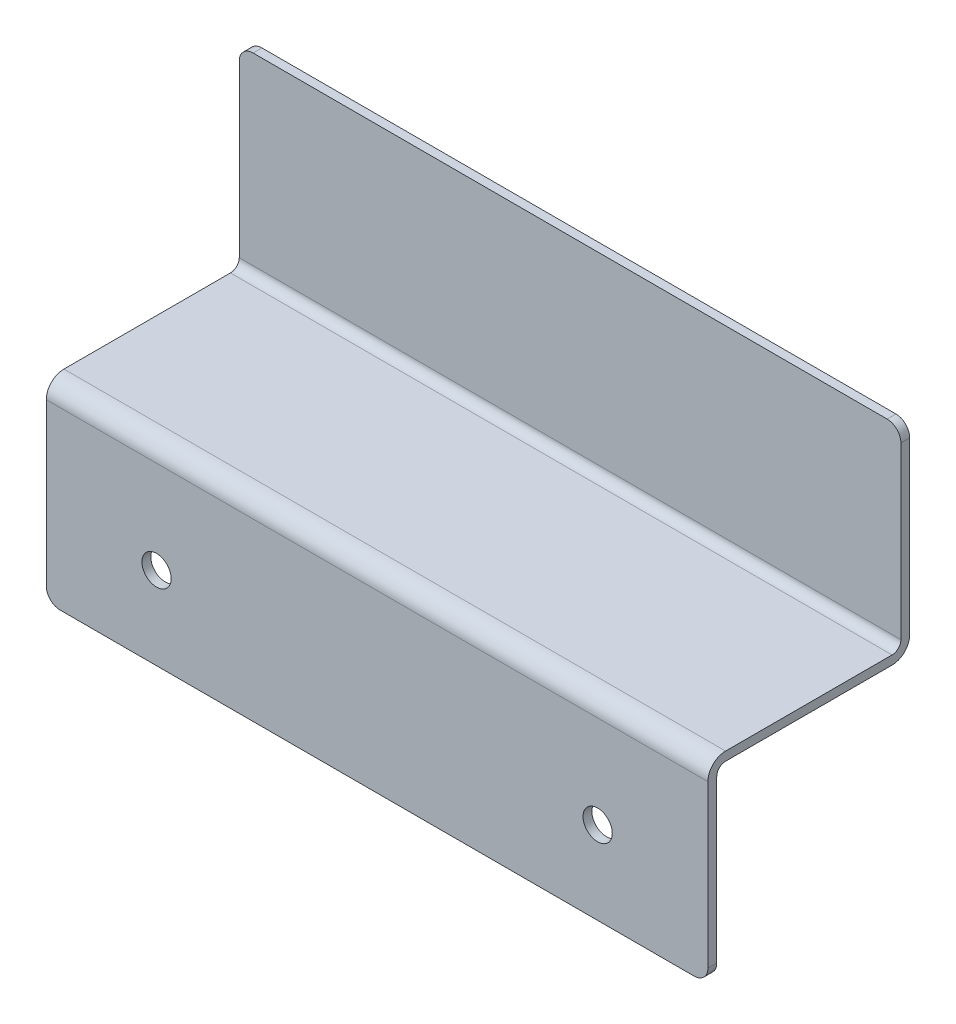
ISO-10303-21;
HEADER;
FILE_DESCRIPTION(('STEP AP214'),'2;1');
FILE_NAME('part.step','',(''),(''),'','','');
FILE_SCHEMA(('AUTOMOTIVE_DESIGN { 1 0 10303 214 1 1 1 1 }'));
ENDSEC;
DATA;
#1=APPLICATION_CONTEXT('core data for automotive mechanical design processes');
#2=APPLICATION_PROTOCOL_DEFINITION('international standard','automotive_design',2000,#1);
#3=PRODUCT_CONTEXT('',#1,'mechanical');
#4=PRODUCT('Part','Part','',(#3));
#5=PRODUCT_RELATED_PRODUCT_CATEGORY('part','',(#4));
#6=PRODUCT_DEFINITION_FORMATION('','',#4);
#7=PRODUCT_DEFINITION_CONTEXT('part definition',#1,'design');
#8=PRODUCT_DEFINITION('design','',#6,#7);
#9=PRODUCT_DEFINITION_SHAPE('','',#8);
#10=(LENGTH_UNIT() NAMED_UNIT(*) SI_UNIT(.MILLI.,.METRE.));
#11=(NAMED_UNIT(*) PLANE_ANGLE_UNIT() SI_UNIT($,.RADIAN.));
#12=(NAMED_UNIT(*) SI_UNIT($,.STERADIAN.) SOLID_ANGLE_UNIT());
#13=UNCERTAINTY_MEASURE_WITH_UNIT(LENGTH_MEASURE(1.E-05),#10,'distance_accuracy_value','');
#14=(GEOMETRIC_REPRESENTATION_CONTEXT(3) GLOBAL_UNCERTAINTY_ASSIGNED_CONTEXT((#13)) GLOBAL_UNIT_ASSIGNED_CONTEXT((#10,
#11,#12)) REPRESENTATION_CONTEXT('',''));
#15=CARTESIAN_POINT('',(0.,0.,0.));
#16=DIRECTION('',(0.,0.,1.));
#17=DIRECTION('',(1.,0.,0.));
#18=AXIS2_PLACEMENT_3D('',#15,#16,#17);
#19=CARTESIAN_POINT('',(152.4,0.,0.));
#20=DIRECTION('',(0.,-1.,0.));
#21=DIRECTION('',(0.,0.,-1.));
#22=AXIS2_PLACEMENT_3D('',#19,#20,#21);
#23=PLANE('',#22);
#24=DIRECTION('',(-1.,0.,0.));
#25=VECTOR('',#24,1.);
#26=CARTESIAN_POINT('',(152.4,0.,-2.032));
#27=LINE('',#26,#25);
#28=CARTESIAN_POINT('',(149.225,0.,-2.032));
#29=VERTEX_POINT('',#28);
#30=CARTESIAN_POINT('',(3.17500000000007,0.,-2.032));
#31=VERTEX_POINT('',#30);
#32=EDGE_CURVE('E187',#29,#31,#27,.T.);
#33=ORIENTED_EDGE('',*,*,#32,.T.);
#34=DIRECTION('',(0.,0.,1.));
#35=VECTOR('',#34,1.);
#36=CARTESIAN_POINT('',(3.17500000000001,0.,0.));
#37=LINE('',#36,#35);
#38=CARTESIAN_POINT('',(3.17500000000007,0.,0.));
#39=VERTEX_POINT('',#38);
#40=EDGE_CURVE('E247',#31,#39,#37,.T.);
#41=ORIENTED_EDGE('',*,*,#40,.T.);
#42=DIRECTION('',(-1.,0.,0.));
#43=VECTOR('',#42,1.);
#44=CARTESIAN_POINT('',(152.4,0.,0.));
#45=LINE('',#44,#43);
#46=CARTESIAN_POINT('',(149.225,0.,0.));
#47=VERTEX_POINT('',#46);
#48=EDGE_CURVE('E172',#47,#39,#45,.T.);
#49=ORIENTED_EDGE('',*,*,#48,.F.);
#50=DIRECTION('',(0.,0.,1.));
#51=VECTOR('',#50,1.);
#52=CARTESIAN_POINT('',(149.225,0.,0.));
#53=LINE('',#52,#51);
#54=EDGE_CURVE('E245',#47,#29,#53,.F.);
#55=ORIENTED_EDGE('',*,*,#54,.T.);
#56=EDGE_LOOP('',(#33,#41,#49,#55));
#57=FACE_BOUND('',#56,.T.);
#58=ADVANCED_FACE('F32',(#57),#23,.F.);
#59=CARTESIAN_POINT('',(152.4,0.,0.));
#60=DIRECTION('',(0.,0.,-1.));
#61=DIRECTION('',(0.,1.,0.));
#62=AXIS2_PLACEMENT_3D('',#59,#60,#61);
#63=PLANE('',#62);
#64=ORIENTED_EDGE('',*,*,#48,.T.);
#65=CARTESIAN_POINT('',(3.17500000000001,-3.175,0.));
#66=DIRECTION('',(0.,0.,-1.));
#67=DIRECTION('',(0.,1.,0.));
#68=AXIS2_PLACEMENT_3D('',#65,#66,#67);
#69=CIRCLE('',#68,3.175);
#70=CARTESIAN_POINT('',(0.,-3.175,0.));
#71=VERTEX_POINT('',#70);
#72=EDGE_CURVE('E251',#39,#71,#69,.F.);
#73=ORIENTED_EDGE('',*,*,#72,.T.);
#74=DIRECTION('',(0.,-1.,0.));
#75=VECTOR('',#74,1.);
#76=CARTESIAN_POINT('',(0.,0.,0.));
#77=LINE('',#76,#75);
#78=CARTESIAN_POINT('',(0.,-42.418,0.));
#79=VERTEX_POINT('',#78);
#80=EDGE_CURVE('E262',#71,#79,#77,.T.);
#81=ORIENTED_EDGE('',*,*,#80,.T.);
#82=DIRECTION('',(-1.,0.,0.));
#83=VECTOR('',#82,1.);
#84=CARTESIAN_POINT('',(152.4,-42.418,0.));
#85=LINE('',#84,#83);
#86=CARTESIAN_POINT('',(152.4,-42.418,0.));
#87=VERTEX_POINT('',#86);
#88=EDGE_CURVE('E162',#79,#87,#85,.F.);
#89=ORIENTED_EDGE('',*,*,#88,.T.);
#90=DIRECTION('',(0.,-1.,0.));
#91=VECTOR('',#90,1.);
#92=CARTESIAN_POINT('',(152.4,0.,0.));
#93=LINE('',#92,#91);
#94=CARTESIAN_POINT('',(152.4,-3.175,0.));
#95=VERTEX_POINT('',#94);
#96=EDGE_CURVE('E181',#95,#87,#93,.T.);
#97=ORIENTED_EDGE('',*,*,#96,.F.);
#98=CARTESIAN_POINT('',(149.225,-3.175,0.));
#99=DIRECTION('',(0.,0.,-1.));
#100=DIRECTION('',(0.,1.,0.));
#101=AXIS2_PLACEMENT_3D('',#98,#99,#100);
#102=CIRCLE('',#101,3.175);
#103=EDGE_CURVE('E57',#95,#47,#102,.F.);
#104=ORIENTED_EDGE('',*,*,#103,.T.);
#105=EDGE_LOOP('',(#64,#73,#81,#89,#97,#104));
#106=FACE_BOUND('',#105,.T.);
#107=ADVANCED_FACE('F334',(#106),#63,.F.);
#108=CARTESIAN_POINT('',(152.4,-44.45,0.));
#109=DIRECTION('',(0.,-1.,0.));
#110=DIRECTION('',(0.,0.,-1.));
#111=AXIS2_PLACEMENT_3D('',#108,#109,#110);
#112=PLANE('',#111);
#113=DIRECTION('',(0.,0.,1.));
#114=VECTOR('',#113,1.);
#115=CARTESIAN_POINT('',(0.,-44.45,0.));
#116=LINE('',#115,#114);
#117=CARTESIAN_POINT('',(0.,-44.45,2.03199999999999));
#118=VERTEX_POINT('',#117);
#119=CARTESIAN_POINT('',(0.,-44.45,40.386));
#120=VERTEX_POINT('',#119);
#121=EDGE_CURVE('E283',#118,#120,#116,.T.);
#122=ORIENTED_EDGE('',*,*,#121,.T.);
#123=DIRECTION('',(-1.,0.,0.));
#124=VECTOR('',#123,1.);
#125=CARTESIAN_POINT('',(152.4,-44.45,40.386));
#126=LINE('',#125,#124);
#127=CARTESIAN_POINT('',(152.4,-44.45,40.386));
#128=VERTEX_POINT('',#127);
#129=EDGE_CURVE('E217',#120,#128,#126,.F.);
#130=ORIENTED_EDGE('',*,*,#129,.T.);
#131=DIRECTION('',(0.,0.,1.));
#132=VECTOR('',#131,1.);
#133=CARTESIAN_POINT('',(152.4,-44.45,0.));
#134=LINE('',#133,#132);
#135=CARTESIAN_POINT('',(152.4,-44.45,2.03199999999999));
#136=VERTEX_POINT('',#135);
#137=EDGE_CURVE('E272',#136,#128,#134,.T.);
#138=ORIENTED_EDGE('',*,*,#137,.F.);
#139=DIRECTION('',(-1.,0.,0.));
#140=VECTOR('',#139,1.);
#141=CARTESIAN_POINT('',(0.,-44.45,2.03199999999999));
#142=LINE('',#141,#140);
#143=EDGE_CURVE('E200',#136,#118,#142,.T.);
#144=ORIENTED_EDGE('',*,*,#143,.T.);
#145=EDGE_LOOP('',(#122,#130,#138,#144));
#146=FACE_BOUND('',#145,.T.);
#147=ADVANCED_FACE('F316',(#146),#112,.F.);
#148=CARTESIAN_POINT('',(152.4,-44.45,44.45));
#149=DIRECTION('',(0.,0.,-1.));
#150=DIRECTION('',(0.,1.,0.));
#151=AXIS2_PLACEMENT_3D('',#148,#149,#150);
#152=PLANE('',#151);
#153=CARTESIAN_POINT('',(25.4,-69.85,44.45));
#154=DIRECTION('',(0.,0.,1.));
#155=DIRECTION('',(1.,0.,0.));
#156=AXIS2_PLACEMENT_3D('',#153,#154,#155);
#157=CIRCLE('',#156,3.3655);
#158=CARTESIAN_POINT('',(28.7655,-69.85,44.45));
#159=VERTEX_POINT('',#158);
#160=EDGE_CURVE('E258',#159,#159,#157,.T.);
#161=ORIENTED_EDGE('',*,*,#160,.F.);
#162=EDGE_LOOP('',(#161));
#163=FACE_BOUND('',#162,.T.);
#164=CARTESIAN_POINT('',(127.,-69.85,44.45));
#165=DIRECTION('',(0.,0.,1.));
#166=DIRECTION('',(1.,0.,0.));
#167=AXIS2_PLACEMENT_3D('',#164,#165,#166);
#168=CIRCLE('',#167,3.36549999999999);
#169=CARTESIAN_POINT('',(130.3655,-69.85,44.45));
#170=VERTEX_POINT('',#169);
#171=EDGE_CURVE('E264',#170,#170,#168,.T.);
#172=ORIENTED_EDGE('',*,*,#171,.F.);
#173=EDGE_LOOP('',(#172));
#174=FACE_BOUND('',#173,.T.);
#175=DIRECTION('',(0.,-1.,0.));
#176=VECTOR('',#175,1.);
#177=CARTESIAN_POINT('',(0.,-44.45,44.45));
#178=LINE('',#177,#176);
#179=CARTESIAN_POINT('',(0.,-48.514,44.45));
#180=VERTEX_POINT('',#179);
#181=CARTESIAN_POINT('',(0.,-85.725,44.45));
#182=VERTEX_POINT('',#181);
#183=EDGE_CURVE('E183',#180,#182,#178,.T.);
#184=ORIENTED_EDGE('',*,*,#183,.T.);
#185=CARTESIAN_POINT('',(3.17500000000001,-85.725,44.45));
#186=DIRECTION('',(0.,0.,-1.));
#187=DIRECTION('',(0.,1.,0.));
#188=AXIS2_PLACEMENT_3D('',#185,#186,#187);
#189=CIRCLE('',#188,3.175);
#190=CARTESIAN_POINT('',(3.17500000000007,-88.9,44.45));
#191=VERTEX_POINT('',#190);
#192=EDGE_CURVE('E243',#182,#191,#189,.F.);
#193=ORIENTED_EDGE('',*,*,#192,.T.);
#194=DIRECTION('',(-1.,0.,0.));
#195=VECTOR('',#194,1.);
#196=CARTESIAN_POINT('',(152.4,-88.9,44.45));
#197=LINE('',#196,#195);
#198=CARTESIAN_POINT('',(149.225,-88.9,44.45));
#199=VERTEX_POINT('',#198);
#200=EDGE_CURVE('E194',#199,#191,#197,.T.);
#201=ORIENTED_EDGE('',*,*,#200,.F.);
#202=CARTESIAN_POINT('',(149.225,-85.725,44.45));
#203=DIRECTION('',(0.,0.,-1.));
#204=DIRECTION('',(0.,1.,0.));
#205=AXIS2_PLACEMENT_3D('',#202,#203,#204);
#206=CIRCLE('',#205,3.175);
#207=CARTESIAN_POINT('',(152.4,-85.725,44.45));
#208=VERTEX_POINT('',#207);
#209=EDGE_CURVE('E241',#199,#208,#206,.F.);
#210=ORIENTED_EDGE('',*,*,#209,.T.);
#211=DIRECTION('',(0.,-1.,0.));
#212=VECTOR('',#211,1.);
#213=CARTESIAN_POINT('',(152.4,-44.45,44.45));
#214=LINE('',#213,#212);
#215=CARTESIAN_POINT('',(152.4,-48.514,44.45));
#216=VERTEX_POINT('',#215);
#217=EDGE_CURVE('E275',#216,#208,#214,.T.);
#218=ORIENTED_EDGE('',*,*,#217,.F.);
#219=DIRECTION('',(-1.,0.,0.));
#220=VECTOR('',#219,1.);
#221=CARTESIAN_POINT('',(152.4,-48.514,44.45));
#222=LINE('',#221,#220);
#223=EDGE_CURVE('E211',#216,#180,#222,.T.);
#224=ORIENTED_EDGE('',*,*,#223,.T.);
#225=EDGE_LOOP('',(#184,#193,#201,#210,#218,#224));
#226=FACE_BOUND('',#225,.T.);
#227=ADVANCED_FACE('F289',(#163,#174,#226),#152,.F.);
#228=CARTESIAN_POINT('',(152.4,-88.9,44.45));
#229=DIRECTION('',(0.,1.,0.));
#230=DIRECTION('',(0.,0.,1.));
#231=AXIS2_PLACEMENT_3D('',#228,#229,#230);
#232=PLANE('',#231);
#233=ORIENTED_EDGE('',*,*,#200,.T.);
#234=DIRECTION('',(0.,0.,-1.));
#235=VECTOR('',#234,1.);
#236=CARTESIAN_POINT('',(3.17500000000001,-88.9,42.418));
#237=LINE('',#236,#235);
#238=CARTESIAN_POINT('',(3.17500000000007,-88.9,42.418));
#239=VERTEX_POINT('',#238);
#240=EDGE_CURVE('E230',#191,#239,#237,.T.);
#241=ORIENTED_EDGE('',*,*,#240,.T.);
#242=DIRECTION('',(-1.,0.,0.));
#243=VECTOR('',#242,1.);
#244=CARTESIAN_POINT('',(152.4,-88.9,42.418));
#245=LINE('',#244,#243);
#246=CARTESIAN_POINT('',(149.225,-88.9,42.418));
#247=VERTEX_POINT('',#246);
#248=EDGE_CURVE('E190',#247,#239,#245,.T.);
#249=ORIENTED_EDGE('',*,*,#248,.F.);
#250=DIRECTION('',(0.,0.,-1.));
#251=VECTOR('',#250,1.);
#252=CARTESIAN_POINT('',(149.225,-88.9,44.45));
#253=LINE('',#252,#251);
#254=EDGE_CURVE('E228',#247,#199,#253,.F.);
#255=ORIENTED_EDGE('',*,*,#254,.T.);
#256=EDGE_LOOP('',(#233,#241,#249,#255));
#257=FACE_BOUND('',#256,.T.);
#258=ADVANCED_FACE('F299',(#257),#232,.F.);
#259=CARTESIAN_POINT('',(152.4,-46.482,42.418));
#260=DIRECTION('',(0.,0.,1.));
#261=DIRECTION('',(0.,-1.,0.));
#262=AXIS2_PLACEMENT_3D('',#259,#260,#261);
#263=PLANE('',#262);
#264=CARTESIAN_POINT('',(25.4,-69.85,42.418));
#265=DIRECTION('',(0.,0.,1.));
#266=DIRECTION('',(0.,-1.,0.));
#267=AXIS2_PLACEMENT_3D('',#264,#265,#266);
#268=CIRCLE('',#267,3.3655);
#269=CARTESIAN_POINT('',(25.4,-73.2155,42.418));
#270=VERTEX_POINT('',#269);
#271=EDGE_CURVE('E36',#270,#270,#268,.T.);
#272=ORIENTED_EDGE('',*,*,#271,.T.);
#273=EDGE_LOOP('',(#272));
#274=FACE_BOUND('',#273,.T.);
#275=CARTESIAN_POINT('',(127.,-69.85,42.418));
#276=DIRECTION('',(0.,0.,1.));
#277=DIRECTION('',(0.,-1.,0.));
#278=AXIS2_PLACEMENT_3D('',#275,#276,#277);
#279=CIRCLE('',#278,3.36549999999999);
#280=CARTESIAN_POINT('',(127.,-73.2155,42.418));
#281=VERTEX_POINT('',#280);
#282=EDGE_CURVE('E256',#281,#281,#279,.T.);
#283=ORIENTED_EDGE('',*,*,#282,.T.);
#284=EDGE_LOOP('',(#283));
#285=FACE_BOUND('',#284,.T.);
#286=ORIENTED_EDGE('',*,*,#248,.T.);
#287=CARTESIAN_POINT('',(3.17500000000001,-85.725,42.418));
#288=DIRECTION('',(0.,0.,1.));
#289=DIRECTION('',(0.,-1.,0.));
#290=AXIS2_PLACEMENT_3D('',#287,#288,#289);
#291=CIRCLE('',#290,3.175);
#292=CARTESIAN_POINT('',(0.,-85.725,42.418));
#293=VERTEX_POINT('',#292);
#294=EDGE_CURVE('E235',#239,#293,#291,.F.);
#295=ORIENTED_EDGE('',*,*,#294,.T.);
#296=DIRECTION('',(0.,1.,0.));
#297=VECTOR('',#296,1.);
#298=CARTESIAN_POINT('',(0.,-46.482,42.418));
#299=LINE('',#298,#297);
#300=CARTESIAN_POINT('',(0.,-48.514,42.418));
#301=VERTEX_POINT('',#300);
#302=EDGE_CURVE('E178',#293,#301,#299,.T.);
#303=ORIENTED_EDGE('',*,*,#302,.T.);
#304=DIRECTION('',(-1.,0.,0.));
#305=VECTOR('',#304,1.);
#306=CARTESIAN_POINT('',(152.4,-48.514,42.418));
#307=LINE('',#306,#305);
#308=CARTESIAN_POINT('',(152.4,-48.514,42.418));
#309=VERTEX_POINT('',#308);
#310=EDGE_CURVE('E157',#301,#309,#307,.F.);
#311=ORIENTED_EDGE('',*,*,#310,.T.);
#312=DIRECTION('',(0.,1.,0.));
#313=VECTOR('',#312,1.);
#314=CARTESIAN_POINT('',(152.4,-46.482,42.418));
#315=LINE('',#314,#313);
#316=CARTESIAN_POINT('',(152.4,-85.725,42.418));
#317=VERTEX_POINT('',#316);
#318=EDGE_CURVE('E278',#317,#309,#315,.T.);
#319=ORIENTED_EDGE('',*,*,#318,.F.);
#320=CARTESIAN_POINT('',(149.225,-85.725,42.418));
#321=DIRECTION('',(0.,0.,1.));
#322=DIRECTION('',(0.,-1.,0.));
#323=AXIS2_PLACEMENT_3D('',#320,#321,#322);
#324=CIRCLE('',#323,3.175);
#325=EDGE_CURVE('E233',#317,#247,#324,.F.);
#326=ORIENTED_EDGE('',*,*,#325,.T.);
#327=EDGE_LOOP('',(#286,#295,#303,#311,#319,#326));
#328=FACE_BOUND('',#327,.T.);
#329=ADVANCED_FACE('F302',(#274,#285,#328),#263,.F.);
#330=CARTESIAN_POINT('',(152.4,-46.482,-2.03200000000001));
#331=DIRECTION('',(0.,1.,0.));
#332=DIRECTION('',(0.,0.,1.));
#333=AXIS2_PLACEMENT_3D('',#330,#331,#332);
#334=PLANE('',#333);
#335=DIRECTION('',(0.,0.,-1.));
#336=VECTOR('',#335,1.);
#337=CARTESIAN_POINT('',(0.,-46.482,-2.03200000000001));
#338=LINE('',#337,#336);
#339=CARTESIAN_POINT('',(0.,-46.482,40.386));
#340=VERTEX_POINT('',#339);
#341=CARTESIAN_POINT('',(0.,-46.482,2.03199999999999));
#342=VERTEX_POINT('',#341);
#343=EDGE_CURVE('E168',#340,#342,#338,.T.);
#344=ORIENTED_EDGE('',*,*,#343,.T.);
#345=DIRECTION('',(-1.,0.,0.));
#346=VECTOR('',#345,1.);
#347=CARTESIAN_POINT('',(152.4,-46.482,2.03199999999999));
#348=LINE('',#347,#346);
#349=CARTESIAN_POINT('',(152.4,-46.482,2.03199999999999));
#350=VERTEX_POINT('',#349);
#351=EDGE_CURVE('E226',#342,#350,#348,.F.);
#352=ORIENTED_EDGE('',*,*,#351,.T.);
#353=DIRECTION('',(0.,0.,-1.));
#354=VECTOR('',#353,1.);
#355=CARTESIAN_POINT('',(152.4,-46.482,-2.03200000000001));
#356=LINE('',#355,#354);
#357=CARTESIAN_POINT('',(152.4,-46.482,40.386));
#358=VERTEX_POINT('',#357);
#359=EDGE_CURVE('E171',#358,#350,#356,.T.);
#360=ORIENTED_EDGE('',*,*,#359,.F.);
#361=DIRECTION('',(-1.,0.,0.));
#362=VECTOR('',#361,1.);
#363=CARTESIAN_POINT('',(0.,-46.482,40.386));
#364=LINE('',#363,#362);
#365=EDGE_CURVE('E155',#358,#340,#364,.T.);
#366=ORIENTED_EDGE('',*,*,#365,.T.);
#367=EDGE_LOOP('',(#344,#352,#360,#366));
#368=FACE_BOUND('',#367,.T.);
#369=ADVANCED_FACE('F167',(#368),#334,.F.);
#370=CARTESIAN_POINT('',(152.4,0.,-2.032));
#371=DIRECTION('',(0.,0.,1.));
#372=DIRECTION('',(0.,-1.,0.));
#373=AXIS2_PLACEMENT_3D('',#370,#371,#372);
#374=PLANE('',#373);
#375=DIRECTION('',(0.,1.,0.));
#376=VECTOR('',#375,1.);
#377=CARTESIAN_POINT('',(0.,0.,-2.032));
#378=LINE('',#377,#376);
#379=CARTESIAN_POINT('',(0.,-42.418,-2.03200000000001));
#380=VERTEX_POINT('',#379);
#381=CARTESIAN_POINT('',(0.,-3.175,-2.032));
#382=VERTEX_POINT('',#381);
#383=EDGE_CURVE('E177',#380,#382,#378,.T.);
#384=ORIENTED_EDGE('',*,*,#383,.T.);
#385=CARTESIAN_POINT('',(3.17500000000001,-3.175,-2.032));
#386=DIRECTION('',(0.,0.,1.));
#387=DIRECTION('',(0.,-1.,0.));
#388=AXIS2_PLACEMENT_3D('',#385,#386,#387);
#389=CIRCLE('',#388,3.175);
#390=EDGE_CURVE('E254',#382,#31,#389,.F.);
#391=ORIENTED_EDGE('',*,*,#390,.T.);
#392=ORIENTED_EDGE('',*,*,#32,.F.);
#393=CARTESIAN_POINT('',(149.225,-3.175,-2.032));
#394=DIRECTION('',(0.,0.,1.));
#395=DIRECTION('',(0.,-1.,0.));
#396=AXIS2_PLACEMENT_3D('',#393,#394,#395);
#397=CIRCLE('',#396,3.175);
#398=CARTESIAN_POINT('',(152.4,-3.175,-2.032));
#399=VERTEX_POINT('',#398);
#400=EDGE_CURVE('E49',#29,#399,#397,.F.);
#401=ORIENTED_EDGE('',*,*,#400,.T.);
#402=DIRECTION('',(0.,1.,0.));
#403=VECTOR('',#402,1.);
#404=CARTESIAN_POINT('',(152.4,0.,-2.032));
#405=LINE('',#404,#403);
#406=CARTESIAN_POINT('',(152.4,-42.418,-2.03200000000001));
#407=VERTEX_POINT('',#406);
#408=EDGE_CURVE('E191',#407,#399,#405,.T.);
#409=ORIENTED_EDGE('',*,*,#408,.F.);
#410=DIRECTION('',(-1.,0.,0.));
#411=VECTOR('',#410,1.);
#412=CARTESIAN_POINT('',(152.4,-42.418,-2.03200000000001));
#413=LINE('',#412,#411);
#414=EDGE_CURVE('E223',#407,#380,#413,.T.);
#415=ORIENTED_EDGE('',*,*,#414,.T.);
#416=EDGE_LOOP('',(#384,#391,#392,#401,#409,#415));
#417=FACE_BOUND('',#416,.T.);
#418=ADVANCED_FACE('F330',(#417),#374,.F.);
#419=CARTESIAN_POINT('',(152.4,0.,0.));
#420=DIRECTION('',(-1.,0.,0.));
#421=DIRECTION('',(0.,0.,1.));
#422=AXIS2_PLACEMENT_3D('',#419,#420,#421);
#423=PLANE('',#422);
#424=ORIENTED_EDGE('',*,*,#217,.T.);
#425=DIRECTION('',(0.,0.,-1.));
#426=VECTOR('',#425,1.);
#427=CARTESIAN_POINT('',(152.4,-85.725,0.));
#428=LINE('',#427,#426);
#429=EDGE_CURVE('E11',#208,#317,#428,.T.);
#430=ORIENTED_EDGE('',*,*,#429,.T.);
#431=ORIENTED_EDGE('',*,*,#318,.T.);
#432=CARTESIAN_POINT('',(152.4,-48.514,40.386));
#433=DIRECTION('',(-1.,0.,0.));
#434=DIRECTION('',(0.,0.,1.));
#435=AXIS2_PLACEMENT_3D('',#432,#433,#434);
#436=CIRCLE('',#435,2.032);
#437=EDGE_CURVE('E161',#309,#358,#436,.T.);
#438=ORIENTED_EDGE('',*,*,#437,.T.);
#439=ORIENTED_EDGE('',*,*,#359,.T.);
#440=CARTESIAN_POINT('',(152.4,-42.418,2.03199999999999));
#441=DIRECTION('',(-1.,0.,0.));
#442=DIRECTION('',(0.,0.,1.));
#443=AXIS2_PLACEMENT_3D('',#440,#441,#442);
#444=CIRCLE('',#443,4.064);
#445=EDGE_CURVE('E219',#350,#407,#444,.F.);
#446=ORIENTED_EDGE('',*,*,#445,.T.);
#447=ORIENTED_EDGE('',*,*,#408,.T.);
#448=DIRECTION('',(0.,0.,1.));
#449=VECTOR('',#448,1.);
#450=CARTESIAN_POINT('',(152.4,-3.175,0.));
#451=LINE('',#450,#449);
#452=EDGE_CURVE('E41',#399,#95,#451,.T.);
#453=ORIENTED_EDGE('',*,*,#452,.T.);
#454=ORIENTED_EDGE('',*,*,#96,.T.);
#455=CARTESIAN_POINT('',(152.4,-42.418,2.03199999999999));
#456=DIRECTION('',(-1.,0.,0.));
#457=DIRECTION('',(0.,0.,1.));
#458=AXIS2_PLACEMENT_3D('',#455,#456,#457);
#459=CIRCLE('',#458,2.032);
#460=EDGE_CURVE('E209',#87,#136,#459,.T.);
#461=ORIENTED_EDGE('',*,*,#460,.T.);
#462=ORIENTED_EDGE('',*,*,#137,.T.);
#463=CARTESIAN_POINT('',(152.4,-48.514,40.386));
#464=DIRECTION('',(-1.,0.,0.));
#465=DIRECTION('',(0.,0.,1.));
#466=AXIS2_PLACEMENT_3D('',#463,#464,#465);
#467=CIRCLE('',#466,4.064);
#468=EDGE_CURVE('E221',#128,#216,#467,.F.);
#469=ORIENTED_EDGE('',*,*,#468,.T.);
#470=EDGE_LOOP('',(#424,#430,#431,#438,#439,#446,#447,#453,#454,#461,#462,#469));
#471=FACE_BOUND('',#470,.T.);
#472=ADVANCED_FACE('F309',(#471),#423,.F.);
#473=CARTESIAN_POINT('',(0.,0.,0.));
#474=DIRECTION('',(-1.,0.,0.));
#475=DIRECTION('',(0.,0.,1.));
#476=AXIS2_PLACEMENT_3D('',#473,#474,#475);
#477=PLANE('',#476);
#478=ORIENTED_EDGE('',*,*,#302,.F.);
#479=DIRECTION('',(0.,0.,-1.));
#480=VECTOR('',#479,1.);
#481=CARTESIAN_POINT('',(0.,-85.725,44.45));
#482=LINE('',#481,#480);
#483=EDGE_CURVE('E239',#293,#182,#482,.F.);
#484=ORIENTED_EDGE('',*,*,#483,.T.);
#485=ORIENTED_EDGE('',*,*,#183,.F.);
#486=CARTESIAN_POINT('',(0.,-48.514,40.386));
#487=DIRECTION('',(-1.,0.,0.));
#488=DIRECTION('',(0.,0.,1.));
#489=AXIS2_PLACEMENT_3D('',#486,#487,#488);
#490=CIRCLE('',#489,4.064);
#491=EDGE_CURVE('E215',#180,#120,#490,.T.);
#492=ORIENTED_EDGE('',*,*,#491,.T.);
#493=ORIENTED_EDGE('',*,*,#121,.F.);
#494=CARTESIAN_POINT('',(0.,-42.418,2.03199999999999));
#495=DIRECTION('',(-1.,0.,0.));
#496=DIRECTION('',(0.,0.,1.));
#497=AXIS2_PLACEMENT_3D('',#494,#495,#496);
#498=CIRCLE('',#497,2.032);
#499=EDGE_CURVE('E206',#118,#79,#498,.F.);
#500=ORIENTED_EDGE('',*,*,#499,.T.);
#501=ORIENTED_EDGE('',*,*,#80,.F.);
#502=DIRECTION('',(0.,0.,1.));
#503=VECTOR('',#502,1.);
#504=CARTESIAN_POINT('',(0.,-3.175,-2.032));
#505=LINE('',#504,#503);
#506=EDGE_CURVE('E237',#71,#382,#505,.F.);
#507=ORIENTED_EDGE('',*,*,#506,.T.);
#508=ORIENTED_EDGE('',*,*,#383,.F.);
#509=CARTESIAN_POINT('',(0.,-42.418,2.03199999999999));
#510=DIRECTION('',(-1.,0.,0.));
#511=DIRECTION('',(0.,0.,1.));
#512=AXIS2_PLACEMENT_3D('',#509,#510,#511);
#513=CIRCLE('',#512,4.064);
#514=EDGE_CURVE('E176',#380,#342,#513,.T.);
#515=ORIENTED_EDGE('',*,*,#514,.T.);
#516=ORIENTED_EDGE('',*,*,#343,.F.);
#517=CARTESIAN_POINT('',(0.,-48.514,40.386));
#518=DIRECTION('',(-1.,0.,0.));
#519=DIRECTION('',(0.,0.,1.));
#520=AXIS2_PLACEMENT_3D('',#517,#518,#519);
#521=CIRCLE('',#520,2.032);
#522=EDGE_CURVE('E151',#340,#301,#521,.F.);
#523=ORIENTED_EDGE('',*,*,#522,.T.);
#524=EDGE_LOOP('',(#478,#484,#485,#492,#493,#500,#501,#507,#508,#515,#516,#523));
#525=FACE_BOUND('',#524,.T.);
#526=ADVANCED_FACE('F174',(#525),#477,.T.);
#527=CARTESIAN_POINT('',(152.4,-48.514,40.386));
#528=DIRECTION('',(1.,0.,0.));
#529=DIRECTION('',(0.,0.,-1.));
#530=AXIS2_PLACEMENT_3D('',#527,#528,#529);
#531=CYLINDRICAL_SURFACE('',#530,2.032);
#532=ORIENTED_EDGE('',*,*,#437,.F.);
#533=ORIENTED_EDGE('',*,*,#310,.F.);
#534=ORIENTED_EDGE('',*,*,#522,.F.);
#535=ORIENTED_EDGE('',*,*,#365,.F.);
#536=EDGE_LOOP('',(#532,#533,#534,#535));
#537=FACE_BOUND('',#536,.T.);
#538=ADVANCED_FACE('F154',(#537),#531,.F.);
#539=CARTESIAN_POINT('',(152.4,-42.418,2.03199999999999));
#540=DIRECTION('',(1.,0.,0.));
#541=DIRECTION('',(0.,0.,-1.));
#542=AXIS2_PLACEMENT_3D('',#539,#540,#541);
#543=CYLINDRICAL_SURFACE('',#542,2.032);
#544=ORIENTED_EDGE('',*,*,#460,.F.);
#545=ORIENTED_EDGE('',*,*,#88,.F.);
#546=ORIENTED_EDGE('',*,*,#499,.F.);
#547=ORIENTED_EDGE('',*,*,#143,.F.);
#548=EDGE_LOOP('',(#544,#545,#546,#547));
#549=FACE_BOUND('',#548,.T.);
#550=ADVANCED_FACE('F321',(#549),#543,.F.);
#551=CARTESIAN_POINT('',(152.4,-48.514,40.386));
#552=DIRECTION('',(-1.,0.,0.));
#553=DIRECTION('',(0.,0.,1.));
#554=AXIS2_PLACEMENT_3D('',#551,#552,#553);
#555=CYLINDRICAL_SURFACE('',#554,4.064);
#556=ORIENTED_EDGE('',*,*,#468,.F.);
#557=ORIENTED_EDGE('',*,*,#129,.F.);
#558=ORIENTED_EDGE('',*,*,#491,.F.);
#559=ORIENTED_EDGE('',*,*,#223,.F.);
#560=EDGE_LOOP('',(#556,#557,#558,#559));
#561=FACE_BOUND('',#560,.T.);
#562=ADVANCED_FACE('F312',(#561),#555,.T.);
#563=CARTESIAN_POINT('',(152.4,-42.418,2.03199999999999));
#564=DIRECTION('',(-1.,0.,0.));
#565=DIRECTION('',(0.,0.,1.));
#566=AXIS2_PLACEMENT_3D('',#563,#564,#565);
#567=CYLINDRICAL_SURFACE('',#566,4.064);
#568=ORIENTED_EDGE('',*,*,#445,.F.);
#569=ORIENTED_EDGE('',*,*,#351,.F.);
#570=ORIENTED_EDGE('',*,*,#514,.F.);
#571=ORIENTED_EDGE('',*,*,#414,.F.);
#572=EDGE_LOOP('',(#568,#569,#570,#571));
#573=FACE_BOUND('',#572,.T.);
#574=ADVANCED_FACE('F351',(#573),#567,.T.);
#575=CARTESIAN_POINT('',(3.17500000000001,-85.725,44.45));
#576=DIRECTION('',(0.,0.,1.));
#577=DIRECTION('',(1.,0.,0.));
#578=AXIS2_PLACEMENT_3D('',#575,#576,#577);
#579=CYLINDRICAL_SURFACE('',#578,3.175);
#580=ORIENTED_EDGE('',*,*,#192,.F.);
#581=ORIENTED_EDGE('',*,*,#483,.F.);
#582=ORIENTED_EDGE('',*,*,#294,.F.);
#583=ORIENTED_EDGE('',*,*,#240,.F.);
#584=EDGE_LOOP('',(#580,#581,#582,#583));
#585=FACE_BOUND('',#584,.T.);
#586=ADVANCED_FACE('F296',(#585),#579,.T.);
#587=CARTESIAN_POINT('',(3.17500000000001,-3.175,0.));
#588=DIRECTION('',(0.,0.,-1.));
#589=DIRECTION('',(-1.,0.,0.));
#590=AXIS2_PLACEMENT_3D('',#587,#588,#589);
#591=CYLINDRICAL_SURFACE('',#590,3.175);
#592=ORIENTED_EDGE('',*,*,#390,.F.);
#593=ORIENTED_EDGE('',*,*,#506,.F.);
#594=ORIENTED_EDGE('',*,*,#72,.F.);
#595=ORIENTED_EDGE('',*,*,#40,.F.);
#596=EDGE_LOOP('',(#592,#593,#594,#595));
#597=FACE_BOUND('',#596,.T.);
#598=ADVANCED_FACE('F328',(#597),#591,.T.);
#599=CARTESIAN_POINT('',(149.225,-85.725,0.));
#600=DIRECTION('',(0.,0.,-1.));
#601=DIRECTION('',(-1.,0.,0.));
#602=AXIS2_PLACEMENT_3D('',#599,#600,#601);
#603=CYLINDRICAL_SURFACE('',#602,3.175);
#604=ORIENTED_EDGE('',*,*,#209,.F.);
#605=ORIENTED_EDGE('',*,*,#254,.F.);
#606=ORIENTED_EDGE('',*,*,#325,.F.);
#607=ORIENTED_EDGE('',*,*,#429,.F.);
#608=EDGE_LOOP('',(#604,#605,#606,#607));
#609=FACE_BOUND('',#608,.T.);
#610=ADVANCED_FACE('F307',(#609),#603,.T.);
#611=CARTESIAN_POINT('',(149.225,-3.175,0.));
#612=DIRECTION('',(0.,0.,1.));
#613=DIRECTION('',(1.,0.,0.));
#614=AXIS2_PLACEMENT_3D('',#611,#612,#613);
#615=CYLINDRICAL_SURFACE('',#614,3.175);
#616=ORIENTED_EDGE('',*,*,#400,.F.);
#617=ORIENTED_EDGE('',*,*,#54,.F.);
#618=ORIENTED_EDGE('',*,*,#103,.F.);
#619=ORIENTED_EDGE('',*,*,#452,.F.);
#620=EDGE_LOOP('',(#616,#617,#618,#619));
#621=FACE_BOUND('',#620,.T.);
#622=ADVANCED_FACE('F34',(#621),#615,.T.);
#623=CARTESIAN_POINT('',(127.,-69.85,-2.03200000000001));
#624=DIRECTION('',(0.,0.,1.));
#625=DIRECTION('',(1.,0.,0.));
#626=AXIS2_PLACEMENT_3D('',#623,#624,#625);
#627=CYLINDRICAL_SURFACE('',#626,3.36549999999999);
#628=ORIENTED_EDGE('',*,*,#171,.T.);
#629=EDGE_LOOP('',(#628));
#630=FACE_BOUND('',#629,.T.);
#631=ORIENTED_EDGE('',*,*,#282,.F.);
#632=EDGE_LOOP('',(#631));
#633=FACE_BOUND('',#632,.T.);
#634=ADVANCED_FACE('F362',(#630,#633),#627,.F.);
#635=CARTESIAN_POINT('',(25.4,-69.85,-2.03200000000001));
#636=DIRECTION('',(0.,0.,1.));
#637=DIRECTION('',(1.,0.,0.));
#638=AXIS2_PLACEMENT_3D('',#635,#636,#637);
#639=CYLINDRICAL_SURFACE('',#638,3.3655);
#640=ORIENTED_EDGE('',*,*,#160,.T.);
#641=EDGE_LOOP('',(#640));
#642=FACE_BOUND('',#641,.T.);
#643=ORIENTED_EDGE('',*,*,#271,.F.);
#644=EDGE_LOOP('',(#643));
#645=FACE_BOUND('',#644,.T.);
#646=ADVANCED_FACE('F366',(#642,#645),#639,.F.);
#647=CLOSED_SHELL('',(#58,#107,#147,#227,#258,#329,#369,#418,#472,#526,#538,#550,#562,#574,#586,
#598,#610,#622,#634,#646));
#648=MANIFOLD_SOLID_BREP('B2',#647);
#649=ADVANCED_BREP_SHAPE_REPRESENTATION('',(#18,#648),#14);
#650=SHAPE_DEFINITION_REPRESENTATION(#9,#649);
ENDSEC;
END-ISO-10303-21;
